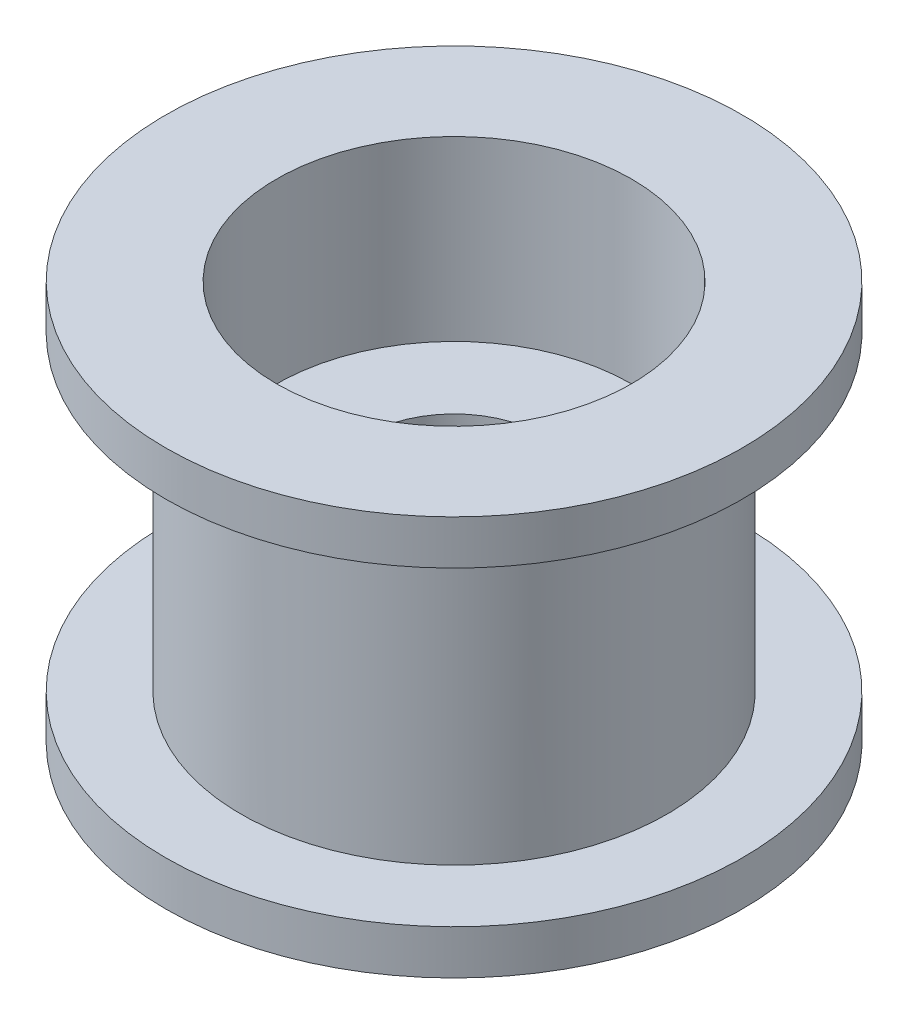
ISO-10303-21;
HEADER;
FILE_DESCRIPTION(('STEP AP214'),'2;1');
FILE_NAME('part.step','',(''),(''),'','','');
FILE_SCHEMA(('AUTOMOTIVE_DESIGN { 1 0 10303 214 1 1 1 1 }'));
ENDSEC;
DATA;
#1=APPLICATION_CONTEXT('core data for automotive mechanical design processes');
#2=APPLICATION_PROTOCOL_DEFINITION('international standard','automotive_design',2000,#1);
#3=PRODUCT_CONTEXT('',#1,'mechanical');
#4=PRODUCT('Part','Part','',(#3));
#5=PRODUCT_RELATED_PRODUCT_CATEGORY('part','',(#4));
#6=PRODUCT_DEFINITION_FORMATION('','',#4);
#7=PRODUCT_DEFINITION_CONTEXT('part definition',#1,'design');
#8=PRODUCT_DEFINITION('design','',#6,#7);
#9=PRODUCT_DEFINITION_SHAPE('','',#8);
#10=(LENGTH_UNIT() NAMED_UNIT(*) SI_UNIT(.MILLI.,.METRE.));
#11=(NAMED_UNIT(*) PLANE_ANGLE_UNIT() SI_UNIT($,.RADIAN.));
#12=(NAMED_UNIT(*) SI_UNIT($,.STERADIAN.) SOLID_ANGLE_UNIT());
#13=UNCERTAINTY_MEASURE_WITH_UNIT(LENGTH_MEASURE(1.E-05),#10,'distance_accuracy_value','');
#14=(GEOMETRIC_REPRESENTATION_CONTEXT(3) GLOBAL_UNCERTAINTY_ASSIGNED_CONTEXT((#13)) GLOBAL_UNIT_ASSIGNED_CONTEXT((#10,
#11,#12)) REPRESENTATION_CONTEXT('',''));
#15=CARTESIAN_POINT('',(0.,0.,0.));
#16=DIRECTION('',(0.,0.,1.));
#17=DIRECTION('',(1.,0.,0.));
#18=AXIS2_PLACEMENT_3D('',#15,#16,#17);
#19=CARTESIAN_POINT('',(0.,-4.5,0.));
#20=DIRECTION('',(0.,-1.,0.));
#21=DIRECTION('',(0.,0.,1.));
#22=AXIS2_PLACEMENT_3D('',#19,#20,#21);
#23=PLANE('',#22);
#24=CARTESIAN_POINT('',(0.,-4.5,0.));
#25=DIRECTION('',(0.,1.,0.));
#26=DIRECTION('',(0.,0.,1.));
#27=AXIS2_PLACEMENT_3D('',#24,#25,#26);
#28=CIRCLE('',#27,6.5);
#29=CARTESIAN_POINT('',(0.,-4.5,6.5));
#30=VERTEX_POINT('',#29);
#31=EDGE_CURVE('E56',#30,#30,#28,.T.);
#32=ORIENTED_EDGE('',*,*,#31,.F.);
#33=EDGE_LOOP('',(#32));
#34=FACE_BOUND('',#33,.T.);
#35=CARTESIAN_POINT('',(0.,-4.5,0.));
#36=DIRECTION('',(0.,1.,0.));
#37=DIRECTION('',(0.,0.,1.));
#38=AXIS2_PLACEMENT_3D('',#35,#36,#37);
#39=CIRCLE('',#38,4.);
#40=CARTESIAN_POINT('',(0.,-4.5,4.));
#41=VERTEX_POINT('',#40);
#42=EDGE_CURVE('E63',#41,#41,#39,.T.);
#43=ORIENTED_EDGE('',*,*,#42,.T.);
#44=EDGE_LOOP('',(#43));
#45=FACE_BOUND('',#44,.T.);
#46=ADVANCED_FACE('F30',(#34,#45),#23,.T.);
#47=CARTESIAN_POINT('',(0.,3.5,0.));
#48=DIRECTION('',(0.,-1.,0.));
#49=DIRECTION('',(0.,0.,-1.));
#50=AXIS2_PLACEMENT_3D('',#47,#48,#49);
#51=CYLINDRICAL_SURFACE('',#50,4.8);
#52=CARTESIAN_POINT('',(0.,3.5,0.));
#53=DIRECTION('',(0.,1.,0.));
#54=DIRECTION('',(0.,0.,1.));
#55=AXIS2_PLACEMENT_3D('',#52,#53,#54);
#56=CIRCLE('',#55,4.8);
#57=CARTESIAN_POINT('',(0.,3.5,4.8));
#58=VERTEX_POINT('',#57);
#59=EDGE_CURVE('E10',#58,#58,#56,.T.);
#60=ORIENTED_EDGE('',*,*,#59,.F.);
#61=EDGE_LOOP('',(#60));
#62=FACE_BOUND('',#61,.T.);
#63=CARTESIAN_POINT('',(0.,-3.5,0.));
#64=DIRECTION('',(0.,-1.,0.));
#65=DIRECTION('',(0.,0.,-1.));
#66=AXIS2_PLACEMENT_3D('',#63,#64,#65);
#67=CIRCLE('',#66,4.8);
#68=CARTESIAN_POINT('',(0.,-3.5,-4.8));
#69=VERTEX_POINT('',#68);
#70=EDGE_CURVE('E51',#69,#69,#67,.T.);
#71=ORIENTED_EDGE('',*,*,#70,.F.);
#72=EDGE_LOOP('',(#71));
#73=FACE_BOUND('',#72,.T.);
#74=ADVANCED_FACE('F32',(#62,#73),#51,.T.);
#75=CARTESIAN_POINT('',(0.,3.5,0.));
#76=DIRECTION('',(0.,1.,0.));
#77=DIRECTION('',(0.,0.,1.));
#78=AXIS2_PLACEMENT_3D('',#75,#76,#77);
#79=PLANE('',#78);
#80=CARTESIAN_POINT('',(0.,3.5,0.));
#81=DIRECTION('',(0.,1.,0.));
#82=DIRECTION('',(0.,0.,1.));
#83=AXIS2_PLACEMENT_3D('',#80,#81,#82);
#84=CIRCLE('',#83,6.5);
#85=CARTESIAN_POINT('',(0.,3.5,6.5));
#86=VERTEX_POINT('',#85);
#87=EDGE_CURVE('E42',#86,#86,#84,.T.);
#88=ORIENTED_EDGE('',*,*,#87,.F.);
#89=EDGE_LOOP('',(#88));
#90=FACE_BOUND('',#89,.T.);
#91=ORIENTED_EDGE('',*,*,#59,.T.);
#92=EDGE_LOOP('',(#91));
#93=FACE_BOUND('',#92,.T.);
#94=ADVANCED_FACE('F96',(#90,#93),#79,.F.);
#95=CARTESIAN_POINT('',(0.,4.5,0.));
#96=DIRECTION('',(0.,-1.,0.));
#97=DIRECTION('',(0.,0.,-1.));
#98=AXIS2_PLACEMENT_3D('',#95,#96,#97);
#99=CYLINDRICAL_SURFACE('',#98,6.5);
#100=CARTESIAN_POINT('',(0.,4.5,0.));
#101=DIRECTION('',(0.,1.,0.));
#102=DIRECTION('',(0.,0.,1.));
#103=AXIS2_PLACEMENT_3D('',#100,#101,#102);
#104=CIRCLE('',#103,6.5);
#105=CARTESIAN_POINT('',(0.,4.5,6.5));
#106=VERTEX_POINT('',#105);
#107=EDGE_CURVE('E38',#106,#106,#104,.T.);
#108=ORIENTED_EDGE('',*,*,#107,.F.);
#109=EDGE_LOOP('',(#108));
#110=FACE_BOUND('',#109,.T.);
#111=ORIENTED_EDGE('',*,*,#87,.T.);
#112=EDGE_LOOP('',(#111));
#113=FACE_BOUND('',#112,.T.);
#114=ADVANCED_FACE('F118',(#110,#113),#99,.T.);
#115=CARTESIAN_POINT('',(0.,4.5,0.));
#116=DIRECTION('',(0.,1.,0.));
#117=DIRECTION('',(0.,0.,1.));
#118=AXIS2_PLACEMENT_3D('',#115,#116,#117);
#119=PLANE('',#118);
#120=CARTESIAN_POINT('',(0.,4.5,0.));
#121=DIRECTION('',(0.,1.,0.));
#122=DIRECTION('',(0.,0.,1.));
#123=AXIS2_PLACEMENT_3D('',#120,#121,#122);
#124=CIRCLE('',#123,4.);
#125=CARTESIAN_POINT('',(0.,4.5,4.));
#126=VERTEX_POINT('',#125);
#127=EDGE_CURVE('E48',#126,#126,#124,.T.);
#128=ORIENTED_EDGE('',*,*,#127,.F.);
#129=EDGE_LOOP('',(#128));
#130=FACE_BOUND('',#129,.T.);
#131=ORIENTED_EDGE('',*,*,#107,.T.);
#132=EDGE_LOOP('',(#131));
#133=FACE_BOUND('',#132,.T.);
#134=ADVANCED_FACE('F114',(#130,#133),#119,.T.);
#135=CARTESIAN_POINT('',(0.,0.5,0.));
#136=DIRECTION('',(0.,1.,0.));
#137=DIRECTION('',(0.,0.,1.));
#138=AXIS2_PLACEMENT_3D('',#135,#136,#137);
#139=CYLINDRICAL_SURFACE('',#138,4.);
#140=CARTESIAN_POINT('',(0.,0.5,0.));
#141=DIRECTION('',(0.,1.,0.));
#142=DIRECTION('',(0.,0.,1.));
#143=AXIS2_PLACEMENT_3D('',#140,#141,#142);
#144=CIRCLE('',#143,4.);
#145=CARTESIAN_POINT('',(0.,0.5,4.));
#146=VERTEX_POINT('',#145);
#147=EDGE_CURVE('E46',#146,#146,#144,.T.);
#148=ORIENTED_EDGE('',*,*,#147,.F.);
#149=EDGE_LOOP('',(#148));
#150=FACE_BOUND('',#149,.T.);
#151=ORIENTED_EDGE('',*,*,#127,.T.);
#152=EDGE_LOOP('',(#151));
#153=FACE_BOUND('',#152,.T.);
#154=ADVANCED_FACE('F110',(#150,#153),#139,.F.);
#155=CARTESIAN_POINT('',(0.,0.5,0.));
#156=DIRECTION('',(0.,1.,0.));
#157=DIRECTION('',(0.,0.,1.));
#158=AXIS2_PLACEMENT_3D('',#155,#156,#157);
#159=PLANE('',#158);
#160=CARTESIAN_POINT('',(0.,0.5,0.));
#161=DIRECTION('',(0.,1.,0.));
#162=DIRECTION('',(0.,0.,1.));
#163=AXIS2_PLACEMENT_3D('',#160,#161,#162);
#164=CIRCLE('',#163,2.);
#165=CARTESIAN_POINT('',(0.,0.5,2.));
#166=VERTEX_POINT('',#165);
#167=EDGE_CURVE('E68',#166,#166,#164,.T.);
#168=ORIENTED_EDGE('',*,*,#167,.F.);
#169=EDGE_LOOP('',(#168));
#170=FACE_BOUND('',#169,.T.);
#171=ORIENTED_EDGE('',*,*,#147,.T.);
#172=EDGE_LOOP('',(#171));
#173=FACE_BOUND('',#172,.T.);
#174=ADVANCED_FACE('F103',(#170,#173),#159,.T.);
#175=CARTESIAN_POINT('',(0.,-3.5,0.));
#176=DIRECTION('',(0.,-1.,0.));
#177=DIRECTION('',(0.,0.,1.));
#178=AXIS2_PLACEMENT_3D('',#175,#176,#177);
#179=PLANE('',#178);
#180=CARTESIAN_POINT('',(0.,-3.5,0.));
#181=DIRECTION('',(0.,1.,0.));
#182=DIRECTION('',(0.,0.,1.));
#183=AXIS2_PLACEMENT_3D('',#180,#181,#182);
#184=CIRCLE('',#183,6.5);
#185=CARTESIAN_POINT('',(0.,-3.5,6.5));
#186=VERTEX_POINT('',#185);
#187=EDGE_CURVE('E57',#186,#186,#184,.T.);
#188=ORIENTED_EDGE('',*,*,#187,.T.);
#189=EDGE_LOOP('',(#188));
#190=FACE_BOUND('',#189,.T.);
#191=ORIENTED_EDGE('',*,*,#70,.T.);
#192=EDGE_LOOP('',(#191));
#193=FACE_BOUND('',#192,.T.);
#194=ADVANCED_FACE('F100',(#190,#193),#179,.F.);
#195=CARTESIAN_POINT('',(0.,-4.5,0.));
#196=DIRECTION('',(0.,1.,0.));
#197=DIRECTION('',(0.,0.,1.));
#198=AXIS2_PLACEMENT_3D('',#195,#196,#197);
#199=CYLINDRICAL_SURFACE('',#198,6.5);
#200=ORIENTED_EDGE('',*,*,#31,.T.);
#201=EDGE_LOOP('',(#200));
#202=FACE_BOUND('',#201,.T.);
#203=ORIENTED_EDGE('',*,*,#187,.F.);
#204=EDGE_LOOP('',(#203));
#205=FACE_BOUND('',#204,.T.);
#206=ADVANCED_FACE('F86',(#202,#205),#199,.T.);
#207=CARTESIAN_POINT('',(0.,-0.5,0.));
#208=DIRECTION('',(0.,-1.,0.));
#209=DIRECTION('',(0.,0.,-1.));
#210=AXIS2_PLACEMENT_3D('',#207,#208,#209);
#211=CYLINDRICAL_SURFACE('',#210,4.);
#212=CARTESIAN_POINT('',(0.,-0.5,0.));
#213=DIRECTION('',(0.,1.,0.));
#214=DIRECTION('',(0.,0.,1.));
#215=AXIS2_PLACEMENT_3D('',#212,#213,#214);
#216=CIRCLE('',#215,4.);
#217=CARTESIAN_POINT('',(0.,-0.5,4.));
#218=VERTEX_POINT('',#217);
#219=EDGE_CURVE('E60',#218,#218,#216,.T.);
#220=ORIENTED_EDGE('',*,*,#219,.T.);
#221=EDGE_LOOP('',(#220));
#222=FACE_BOUND('',#221,.T.);
#223=ORIENTED_EDGE('',*,*,#42,.F.);
#224=EDGE_LOOP('',(#223));
#225=FACE_BOUND('',#224,.T.);
#226=ADVANCED_FACE('F80',(#222,#225),#211,.F.);
#227=CARTESIAN_POINT('',(0.,-0.5,0.));
#228=DIRECTION('',(0.,-1.,0.));
#229=DIRECTION('',(0.,0.,1.));
#230=AXIS2_PLACEMENT_3D('',#227,#228,#229);
#231=PLANE('',#230);
#232=CARTESIAN_POINT('',(0.,-0.5,0.));
#233=DIRECTION('',(0.,-1.,0.));
#234=DIRECTION('',(0.,0.,-1.));
#235=AXIS2_PLACEMENT_3D('',#232,#233,#234);
#236=CIRCLE('',#235,2.);
#237=CARTESIAN_POINT('',(0.,-0.5,-2.));
#238=VERTEX_POINT('',#237);
#239=EDGE_CURVE('E34',#238,#238,#236,.T.);
#240=ORIENTED_EDGE('',*,*,#239,.F.);
#241=EDGE_LOOP('',(#240));
#242=FACE_BOUND('',#241,.T.);
#243=ORIENTED_EDGE('',*,*,#219,.F.);
#244=EDGE_LOOP('',(#243));
#245=FACE_BOUND('',#244,.T.);
#246=ADVANCED_FACE('F77',(#242,#245),#231,.T.);
#247=CARTESIAN_POINT('',(0.,-4.5,0.));
#248=DIRECTION('',(0.,1.,0.));
#249=DIRECTION('',(0.,0.,1.));
#250=AXIS2_PLACEMENT_3D('',#247,#248,#249);
#251=CYLINDRICAL_SURFACE('',#250,2.);
#252=ORIENTED_EDGE('',*,*,#239,.T.);
#253=EDGE_LOOP('',(#252));
#254=FACE_BOUND('',#253,.T.);
#255=ORIENTED_EDGE('',*,*,#167,.T.);
#256=EDGE_LOOP('',(#255));
#257=FACE_BOUND('',#256,.T.);
#258=ADVANCED_FACE('F75',(#254,#257),#251,.F.);
#259=CLOSED_SHELL('',(#46,#74,#94,#114,#134,#154,#174,#194,#206,#226,#246,#258));
#260=MANIFOLD_SOLID_BREP('B2',#259);
#261=ADVANCED_BREP_SHAPE_REPRESENTATION('',(#18,#260),#14);
#262=SHAPE_DEFINITION_REPRESENTATION(#9,#261);
ENDSEC;
END-ISO-10303-21;
